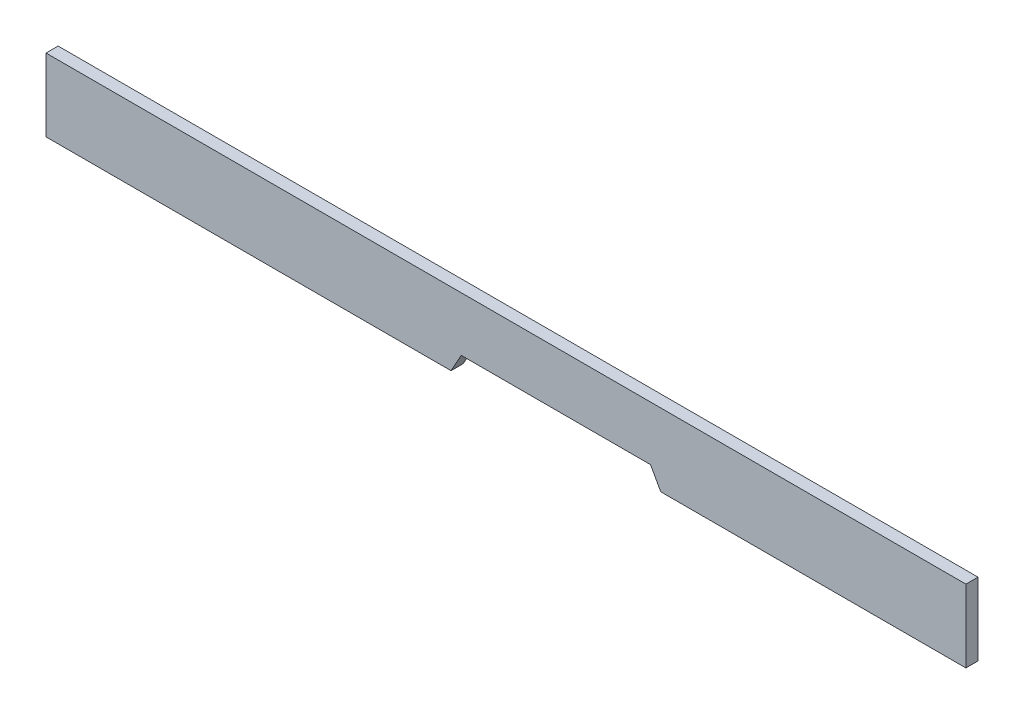
ISO-10303-21;
HEADER;
FILE_DESCRIPTION(('STEP AP214'),'2;1');
FILE_NAME('part.step','',(''),(''),'','','');
FILE_SCHEMA(('AUTOMOTIVE_DESIGN { 1 0 10303 214 1 1 1 1 }'));
ENDSEC;
DATA;
#1=APPLICATION_CONTEXT('core data for automotive mechanical design processes');
#2=APPLICATION_PROTOCOL_DEFINITION('international standard','automotive_design',2000,#1);
#3=PRODUCT_CONTEXT('',#1,'mechanical');
#4=PRODUCT('Part','Part','',(#3));
#5=PRODUCT_RELATED_PRODUCT_CATEGORY('part','',(#4));
#6=PRODUCT_DEFINITION_FORMATION('','',#4);
#7=PRODUCT_DEFINITION_CONTEXT('part definition',#1,'design');
#8=PRODUCT_DEFINITION('design','',#6,#7);
#9=PRODUCT_DEFINITION_SHAPE('','',#8);
#10=(LENGTH_UNIT() NAMED_UNIT(*) SI_UNIT(.MILLI.,.METRE.));
#11=(NAMED_UNIT(*) PLANE_ANGLE_UNIT() SI_UNIT($,.RADIAN.));
#12=(NAMED_UNIT(*) SI_UNIT($,.STERADIAN.) SOLID_ANGLE_UNIT());
#13=UNCERTAINTY_MEASURE_WITH_UNIT(LENGTH_MEASURE(1.E-05),#10,'distance_accuracy_value','');
#14=(GEOMETRIC_REPRESENTATION_CONTEXT(3) GLOBAL_UNCERTAINTY_ASSIGNED_CONTEXT((#13)) GLOBAL_UNIT_ASSIGNED_CONTEXT((#10,
#11,#12)) REPRESENTATION_CONTEXT('',''));
#15=CARTESIAN_POINT('',(0.,0.,0.));
#16=DIRECTION('',(0.,0.,1.));
#17=DIRECTION('',(1.,0.,0.));
#18=AXIS2_PLACEMENT_3D('',#15,#16,#17);
#19=CARTESIAN_POINT('',(-60.325,-4.7625,0.79375));
#20=DIRECTION('',(0.,1.,0.));
#21=DIRECTION('',(0.,0.,1.));
#22=AXIS2_PLACEMENT_3D('',#19,#20,#21);
#23=PLANE('',#22);
#24=DIRECTION('',(1.,0.,0.));
#25=VECTOR('',#24,1.);
#26=CARTESIAN_POINT('',(-60.325,-4.7625,-0.79375));
#27=LINE('',#26,#25);
#28=CARTESIAN_POINT('',(-60.325,-4.7625,-0.79375));
#29=VERTEX_POINT('',#28);
#30=CARTESIAN_POINT('',(-7.20224356351779,-4.7625,-0.79375));
#31=VERTEX_POINT('',#30);
#32=EDGE_CURVE('E120',#29,#31,#27,.T.);
#33=ORIENTED_EDGE('',*,*,#32,.T.);
#34=DIRECTION('',(0.,0.,1.));
#35=VECTOR('',#34,1.);
#36=CARTESIAN_POINT('',(-7.20224356351779,-4.7625,-0.79375));
#37=LINE('',#36,#35);
#38=CARTESIAN_POINT('',(-7.20224356351779,-4.7625,0.79375));
#39=VERTEX_POINT('',#38);
#40=EDGE_CURVE('E146',#31,#39,#37,.T.);
#41=ORIENTED_EDGE('',*,*,#40,.T.);
#42=DIRECTION('',(1.,0.,0.));
#43=VECTOR('',#42,1.);
#44=CARTESIAN_POINT('',(-60.325,-4.7625,0.79375));
#45=LINE('',#44,#43);
#46=CARTESIAN_POINT('',(-60.325,-4.7625,0.79375));
#47=VERTEX_POINT('',#46);
#48=EDGE_CURVE('E132',#47,#39,#45,.T.);
#49=ORIENTED_EDGE('',*,*,#48,.F.);
#50=DIRECTION('',(0.,0.,-1.));
#51=VECTOR('',#50,1.);
#52=CARTESIAN_POINT('',(-60.325,-4.7625,0.79375));
#53=LINE('',#52,#51);
#54=EDGE_CURVE('E131',#47,#29,#53,.T.);
#55=ORIENTED_EDGE('',*,*,#54,.T.);
#56=EDGE_LOOP('',(#33,#41,#49,#55));
#57=FACE_BOUND('',#56,.T.);
#58=ADVANCED_FACE('F30',(#57),#23,.F.);
#59=CARTESIAN_POINT('',(60.325,-4.7625,0.79375));
#60=DIRECTION('',(-1.,0.,0.));
#61=DIRECTION('',(0.,0.,1.));
#62=AXIS2_PLACEMENT_3D('',#59,#60,#61);
#63=PLANE('',#62);
#64=DIRECTION('',(0.,1.,0.));
#65=VECTOR('',#64,1.);
#66=CARTESIAN_POINT('',(60.325,-4.7625,-0.79375));
#67=LINE('',#66,#65);
#68=CARTESIAN_POINT('',(60.325,-4.7625,-0.79375));
#69=VERTEX_POINT('',#68);
#70=CARTESIAN_POINT('',(60.325,4.7625,-0.79375));
#71=VERTEX_POINT('',#70);
#72=EDGE_CURVE('E119',#69,#71,#67,.T.);
#73=ORIENTED_EDGE('',*,*,#72,.T.);
#74=DIRECTION('',(0.,0.,-1.));
#75=VECTOR('',#74,1.);
#76=CARTESIAN_POINT('',(60.325,4.7625,0.79375));
#77=LINE('',#76,#75);
#78=CARTESIAN_POINT('',(60.325,4.7625,0.79375));
#79=VERTEX_POINT('',#78);
#80=EDGE_CURVE('E11',#79,#71,#77,.T.);
#81=ORIENTED_EDGE('',*,*,#80,.F.);
#82=DIRECTION('',(0.,1.,0.));
#83=VECTOR('',#82,1.);
#84=CARTESIAN_POINT('',(60.325,-4.7625,0.79375));
#85=LINE('',#84,#83);
#86=CARTESIAN_POINT('',(60.325,-4.7625,0.79375));
#87=VERTEX_POINT('',#86);
#88=EDGE_CURVE('E124',#87,#79,#85,.T.);
#89=ORIENTED_EDGE('',*,*,#88,.F.);
#90=DIRECTION('',(0.,0.,-1.));
#91=VECTOR('',#90,1.);
#92=CARTESIAN_POINT('',(60.325,-4.7625,0.79375));
#93=LINE('',#92,#91);
#94=EDGE_CURVE('E129',#87,#69,#93,.T.);
#95=ORIENTED_EDGE('',*,*,#94,.T.);
#96=EDGE_LOOP('',(#73,#81,#89,#95));
#97=FACE_BOUND('',#96,.T.);
#98=ADVANCED_FACE('F32',(#97),#63,.F.);
#99=CARTESIAN_POINT('',(-60.325,4.7625,0.79375));
#100=DIRECTION('',(0.,-1.,0.));
#101=DIRECTION('',(0.,0.,-1.));
#102=AXIS2_PLACEMENT_3D('',#99,#100,#101);
#103=PLANE('',#102);
#104=DIRECTION('',(-1.,0.,0.));
#105=VECTOR('',#104,1.);
#106=CARTESIAN_POINT('',(-60.325,4.7625,-0.79375));
#107=LINE('',#106,#105);
#108=CARTESIAN_POINT('',(-60.325,4.7625,-0.79375));
#109=VERTEX_POINT('',#108);
#110=EDGE_CURVE('E125',#71,#109,#107,.T.);
#111=ORIENTED_EDGE('',*,*,#110,.T.);
#112=DIRECTION('',(0.,0.,-1.));
#113=VECTOR('',#112,1.);
#114=CARTESIAN_POINT('',(-60.325,4.7625,0.79375));
#115=LINE('',#114,#113);
#116=CARTESIAN_POINT('',(-60.325,4.7625,0.79375));
#117=VERTEX_POINT('',#116);
#118=EDGE_CURVE('E38',#117,#109,#115,.T.);
#119=ORIENTED_EDGE('',*,*,#118,.F.);
#120=DIRECTION('',(-1.,0.,0.));
#121=VECTOR('',#120,1.);
#122=CARTESIAN_POINT('',(-60.325,4.7625,0.79375));
#123=LINE('',#122,#121);
#124=EDGE_CURVE('E83',#79,#117,#123,.T.);
#125=ORIENTED_EDGE('',*,*,#124,.F.);
#126=ORIENTED_EDGE('',*,*,#80,.T.);
#127=EDGE_LOOP('',(#111,#119,#125,#126));
#128=FACE_BOUND('',#127,.T.);
#129=ADVANCED_FACE('F153',(#128),#103,.F.);
#130=CARTESIAN_POINT('',(-60.325,-4.7625,0.79375));
#131=DIRECTION('',(1.,0.,0.));
#132=DIRECTION('',(0.,0.,-1.));
#133=AXIS2_PLACEMENT_3D('',#130,#131,#132);
#134=PLANE('',#133);
#135=DIRECTION('',(0.,-1.,0.));
#136=VECTOR('',#135,1.);
#137=CARTESIAN_POINT('',(-60.325,-4.7625,-0.79375));
#138=LINE('',#137,#136);
#139=EDGE_CURVE('E121',#109,#29,#138,.T.);
#140=ORIENTED_EDGE('',*,*,#139,.T.);
#141=ORIENTED_EDGE('',*,*,#54,.F.);
#142=DIRECTION('',(0.,-1.,0.));
#143=VECTOR('',#142,1.);
#144=CARTESIAN_POINT('',(-60.325,-4.7625,0.79375));
#145=LINE('',#144,#143);
#146=EDGE_CURVE('E140',#117,#47,#145,.T.);
#147=ORIENTED_EDGE('',*,*,#146,.F.);
#148=ORIENTED_EDGE('',*,*,#118,.T.);
#149=EDGE_LOOP('',(#140,#141,#147,#148));
#150=FACE_BOUND('',#149,.T.);
#151=ADVANCED_FACE('F138',(#150),#134,.F.);
#152=CARTESIAN_POINT('',(20.306940273432,-4.7625,0.79375));
#153=VERTEX_POINT('',#152);
#154=EDGE_CURVE('E54',#153,#87,#45,.T.);
#155=ORIENTED_EDGE('',*,*,#154,.F.);
#156=DIRECTION('',(0.,0.,1.));
#157=VECTOR('',#156,1.);
#158=CARTESIAN_POINT('',(20.306940273432,-4.7625,-0.79375));
#159=LINE('',#158,#157);
#160=CARTESIAN_POINT('',(20.306940273432,-4.7625,-0.79375));
#161=VERTEX_POINT('',#160);
#162=EDGE_CURVE('E107',#161,#153,#159,.T.);
#163=ORIENTED_EDGE('',*,*,#162,.F.);
#164=EDGE_CURVE('E76',#161,#69,#27,.T.);
#165=ORIENTED_EDGE('',*,*,#164,.T.);
#166=ORIENTED_EDGE('',*,*,#94,.F.);
#167=EDGE_LOOP('',(#155,#163,#165,#166));
#168=FACE_BOUND('',#167,.T.);
#169=ADVANCED_FACE('F112',(#168),#23,.F.);
#170=CARTESIAN_POINT('',(60.325,4.7625,0.79375));
#171=DIRECTION('',(0.,0.,-1.));
#172=DIRECTION('',(-1.,0.,0.));
#173=AXIS2_PLACEMENT_3D('',#170,#171,#172);
#174=PLANE('',#173);
#175=ORIENTED_EDGE('',*,*,#48,.T.);
#176=DIRECTION('',(-0.487307871065518,-0.873230232411586,0.));
#177=VECTOR('',#176,1.);
#178=CARTESIAN_POINT('',(-7.20224356351779,-4.7625,0.79375));
#179=LINE('',#178,#177);
#180=CARTESIAN_POINT('',(-5.85566410573413,-2.3495,0.79375));
#181=VERTEX_POINT('',#180);
#182=EDGE_CURVE('E110',#181,#39,#179,.T.);
#183=ORIENTED_EDGE('',*,*,#182,.F.);
#184=DIRECTION('',(-1.,0.,0.));
#185=VECTOR('',#184,1.);
#186=CARTESIAN_POINT('',(-5.85566410573413,-2.3495,0.79375));
#187=LINE('',#186,#185);
#188=CARTESIAN_POINT('',(18.9603608156484,-2.3495,0.79375));
#189=VERTEX_POINT('',#188);
#190=EDGE_CURVE('E164',#189,#181,#187,.T.);
#191=ORIENTED_EDGE('',*,*,#190,.F.);
#192=DIRECTION('',(-0.487307871065518,0.873230232411586,0.));
#193=VECTOR('',#192,1.);
#194=CARTESIAN_POINT('',(18.9603608156484,-2.3495,0.79375));
#195=LINE('',#194,#193);
#196=EDGE_CURVE('E167',#153,#189,#195,.T.);
#197=ORIENTED_EDGE('',*,*,#196,.F.);
#198=ORIENTED_EDGE('',*,*,#154,.T.);
#199=ORIENTED_EDGE('',*,*,#88,.T.);
#200=ORIENTED_EDGE('',*,*,#124,.T.);
#201=ORIENTED_EDGE('',*,*,#146,.T.);
#202=EDGE_LOOP('',(#175,#183,#191,#197,#198,#199,#200,#201));
#203=FACE_BOUND('',#202,.T.);
#204=ADVANCED_FACE('F171',(#203),#174,.F.);
#205=CARTESIAN_POINT('',(60.325,4.7625,-0.79375));
#206=DIRECTION('',(0.,0.,-1.));
#207=DIRECTION('',(-1.,0.,0.));
#208=AXIS2_PLACEMENT_3D('',#205,#206,#207);
#209=PLANE('',#208);
#210=DIRECTION('',(-0.487307871065518,-0.873230232411586,0.));
#211=VECTOR('',#210,1.);
#212=CARTESIAN_POINT('',(-7.20224356351779,-4.7625,-0.79375));
#213=LINE('',#212,#211);
#214=CARTESIAN_POINT('',(-5.85566410573413,-2.3495,-0.79375));
#215=VERTEX_POINT('',#214);
#216=EDGE_CURVE('E113',#215,#31,#213,.T.);
#217=ORIENTED_EDGE('',*,*,#216,.T.);
#218=ORIENTED_EDGE('',*,*,#32,.F.);
#219=ORIENTED_EDGE('',*,*,#139,.F.);
#220=ORIENTED_EDGE('',*,*,#110,.F.);
#221=ORIENTED_EDGE('',*,*,#72,.F.);
#222=ORIENTED_EDGE('',*,*,#164,.F.);
#223=DIRECTION('',(-0.487307871065518,0.873230232411586,0.));
#224=VECTOR('',#223,1.);
#225=CARTESIAN_POINT('',(18.9603608156484,-2.3495,-0.79375));
#226=LINE('',#225,#224);
#227=CARTESIAN_POINT('',(18.9603608156484,-2.3495,-0.79375));
#228=VERTEX_POINT('',#227);
#229=EDGE_CURVE('E104',#161,#228,#226,.T.);
#230=ORIENTED_EDGE('',*,*,#229,.T.);
#231=DIRECTION('',(-1.,0.,0.));
#232=VECTOR('',#231,1.);
#233=CARTESIAN_POINT('',(-5.85566410573413,-2.3495,-0.79375));
#234=LINE('',#233,#232);
#235=EDGE_CURVE('E45',#228,#215,#234,.T.);
#236=ORIENTED_EDGE('',*,*,#235,.T.);
#237=EDGE_LOOP('',(#217,#218,#219,#220,#221,#222,#230,#236));
#238=FACE_BOUND('',#237,.T.);
#239=ADVANCED_FACE('F117',(#238),#209,.T.);
#240=CARTESIAN_POINT('',(-7.20224356351779,-4.7625,-0.79375));
#241=DIRECTION('',(-0.873230232411586,0.487307871065518,0.));
#242=DIRECTION('',(-0.487307871065518,-0.873230232411586,0.));
#243=AXIS2_PLACEMENT_3D('',#240,#241,#242);
#244=PLANE('',#243);
#245=ORIENTED_EDGE('',*,*,#182,.T.);
#246=ORIENTED_EDGE('',*,*,#40,.F.);
#247=ORIENTED_EDGE('',*,*,#216,.F.);
#248=DIRECTION('',(0.,0.,1.));
#249=VECTOR('',#248,1.);
#250=CARTESIAN_POINT('',(-5.85566410573413,-2.3495,-0.79375));
#251=LINE('',#250,#249);
#252=EDGE_CURVE('E160',#215,#181,#251,.T.);
#253=ORIENTED_EDGE('',*,*,#252,.T.);
#254=EDGE_LOOP('',(#245,#246,#247,#253));
#255=FACE_BOUND('',#254,.T.);
#256=ADVANCED_FACE('F174',(#255),#244,.F.);
#257=CARTESIAN_POINT('',(-5.85566410573413,-2.3495,-0.79375));
#258=DIRECTION('',(0.,1.,0.));
#259=DIRECTION('',(0.,0.,1.));
#260=AXIS2_PLACEMENT_3D('',#257,#258,#259);
#261=PLANE('',#260);
#262=ORIENTED_EDGE('',*,*,#190,.T.);
#263=ORIENTED_EDGE('',*,*,#252,.F.);
#264=ORIENTED_EDGE('',*,*,#235,.F.);
#265=DIRECTION('',(0.,0.,1.));
#266=VECTOR('',#265,1.);
#267=CARTESIAN_POINT('',(18.9603608156484,-2.3495,-0.79375));
#268=LINE('',#267,#266);
#269=EDGE_CURVE('E108',#228,#189,#268,.T.);
#270=ORIENTED_EDGE('',*,*,#269,.T.);
#271=EDGE_LOOP('',(#262,#263,#264,#270));
#272=FACE_BOUND('',#271,.T.);
#273=ADVANCED_FACE('F172',(#272),#261,.F.);
#274=CARTESIAN_POINT('',(18.9603608156484,-2.3495,-0.79375));
#275=DIRECTION('',(0.873230232411586,0.487307871065518,0.));
#276=DIRECTION('',(-0.487307871065518,0.873230232411586,0.));
#277=AXIS2_PLACEMENT_3D('',#274,#275,#276);
#278=PLANE('',#277);
#279=ORIENTED_EDGE('',*,*,#196,.T.);
#280=ORIENTED_EDGE('',*,*,#269,.F.);
#281=ORIENTED_EDGE('',*,*,#229,.F.);
#282=ORIENTED_EDGE('',*,*,#162,.T.);
#283=EDGE_LOOP('',(#279,#280,#281,#282));
#284=FACE_BOUND('',#283,.T.);
#285=ADVANCED_FACE('F106',(#284),#278,.F.);
#286=CLOSED_SHELL('',(#58,#98,#129,#151,#169,#204,#239,#256,#273,#285));
#287=MANIFOLD_SOLID_BREP('B2',#286);
#288=ADVANCED_BREP_SHAPE_REPRESENTATION('',(#18,#287),#14);
#289=SHAPE_DEFINITION_REPRESENTATION(#9,#288);
ENDSEC;
END-ISO-10303-21;
